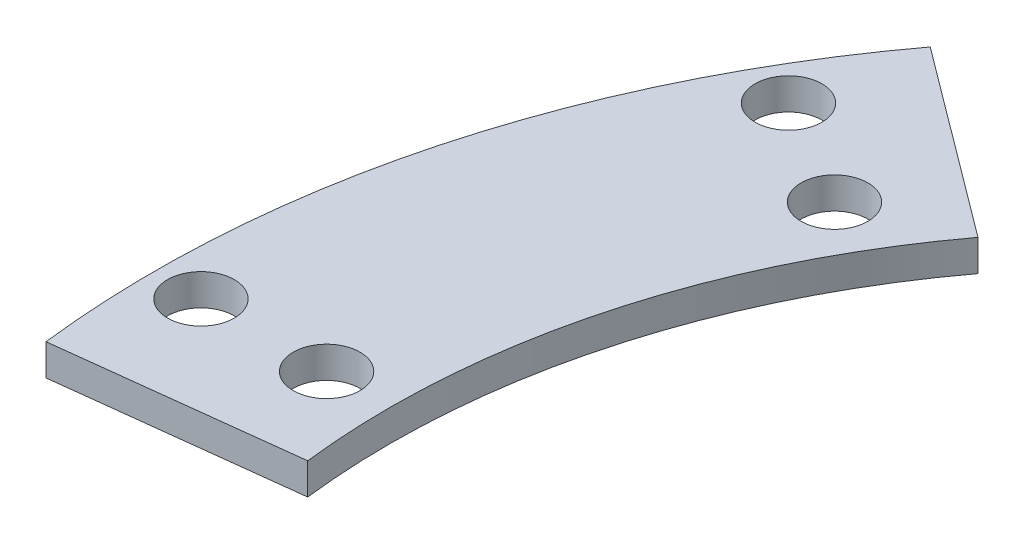
ISO-10303-21;
HEADER;
FILE_DESCRIPTION(('STEP AP214'),'2;1');
FILE_NAME('part.step','',(''),(''),'','','');
FILE_SCHEMA(('AUTOMOTIVE_DESIGN { 1 0 10303 214 1 1 1 1 }'));
ENDSEC;
DATA;
#1=APPLICATION_CONTEXT('core data for automotive mechanical design processes');
#2=APPLICATION_PROTOCOL_DEFINITION('international standard','automotive_design',2000,#1);
#3=PRODUCT_CONTEXT('',#1,'mechanical');
#4=PRODUCT('Part','Part','',(#3));
#5=PRODUCT_RELATED_PRODUCT_CATEGORY('part','',(#4));
#6=PRODUCT_DEFINITION_FORMATION('','',#4);
#7=PRODUCT_DEFINITION_CONTEXT('part definition',#1,'design');
#8=PRODUCT_DEFINITION('design','',#6,#7);
#9=PRODUCT_DEFINITION_SHAPE('','',#8);
#10=(LENGTH_UNIT() NAMED_UNIT(*) SI_UNIT(.MILLI.,.METRE.));
#11=(NAMED_UNIT(*) PLANE_ANGLE_UNIT() SI_UNIT($,.RADIAN.));
#12=(NAMED_UNIT(*) SI_UNIT($,.STERADIAN.) SOLID_ANGLE_UNIT());
#13=UNCERTAINTY_MEASURE_WITH_UNIT(LENGTH_MEASURE(1.E-05),#10,'distance_accuracy_value','');
#14=(GEOMETRIC_REPRESENTATION_CONTEXT(3) GLOBAL_UNCERTAINTY_ASSIGNED_CONTEXT((#13)) GLOBAL_UNIT_ASSIGNED_CONTEXT((#10,
#11,#12)) REPRESENTATION_CONTEXT('',''));
#15=CARTESIAN_POINT('',(0.,0.,0.));
#16=DIRECTION('',(0.,0.,1.));
#17=DIRECTION('',(1.,0.,0.));
#18=AXIS2_PLACEMENT_3D('',#15,#16,#17);
#19=CARTESIAN_POINT('',(0.,2.,0.));
#20=DIRECTION('',(0.,1.,0.));
#21=DIRECTION('',(0.,0.,1.));
#22=AXIS2_PLACEMENT_3D('',#19,#20,#21);
#23=PLANE('',#22);
#24=CARTESIAN_POINT('',(-44.1672955930063,2.,-25.5));
#25=DIRECTION('',(0.,1.,0.));
#26=DIRECTION('',(0.,0.,1.));
#27=AXIS2_PLACEMENT_3D('',#24,#25,#26);
#28=CIRCLE('',#27,2.125);
#29=CARTESIAN_POINT('',(-44.1672955930063,2.,-23.375));
#30=VERTEX_POINT('',#29);
#31=EDGE_CURVE('E123',#30,#30,#28,.T.);
#32=ORIENTED_EDGE('',*,*,#31,.F.);
#33=EDGE_LOOP('',(#32));
#34=FACE_BOUND('',#33,.T.);
#35=CARTESIAN_POINT('',(-51.0954988232818,2.,-29.5));
#36=DIRECTION('',(0.,1.,0.));
#37=DIRECTION('',(0.,0.,1.));
#38=AXIS2_PLACEMENT_3D('',#35,#36,#37);
#39=CIRCLE('',#38,2.125);
#40=CARTESIAN_POINT('',(-51.0954988232818,2.,-27.3750000000001));
#41=VERTEX_POINT('',#40);
#42=EDGE_CURVE('E102',#41,#41,#39,.T.);
#43=ORIENTED_EDGE('',*,*,#42,.F.);
#44=EDGE_LOOP('',(#43));
#45=FACE_BOUND('',#44,.T.);
#46=CARTESIAN_POINT('',(0.,2.,0.));
#47=DIRECTION('',(0.,-1.,0.));
#48=DIRECTION('',(0.,0.,1.));
#49=AXIS2_PLACEMENT_3D('',#46,#47,#48);
#50=CIRCLE('',#49,47.);
#51=CARTESIAN_POINT('',(-46.6736071622532,2.,5.52941176470589));
#52=VERTEX_POINT('',#51);
#53=CARTESIAN_POINT('',(-37.6558236064136,2.,-28.1254146373465));
#54=VERTEX_POINT('',#53);
#55=EDGE_CURVE('E87',#52,#54,#50,.T.);
#56=ORIENTED_EDGE('',*,*,#55,.T.);
#57=DIRECTION('',(-0.801187736306673,0.,-0.59841307739035));
#58=VECTOR('',#57,1.);
#59=CARTESIAN_POINT('',(-37.6558236064136,2.,-28.1254146373465));
#60=LINE('',#59,#58);
#61=CARTESIAN_POINT('',(-49.6736396510137,2.,-37.1016107982017));
#62=VERTEX_POINT('',#61);
#63=EDGE_CURVE('E82',#54,#62,#60,.T.);
#64=ORIENTED_EDGE('',*,*,#63,.T.);
#65=CARTESIAN_POINT('',(0.,2.,0.));
#66=DIRECTION('',(0.,1.,0.));
#67=DIRECTION('',(0.,0.,1.));
#68=AXIS2_PLACEMENT_3D('',#65,#66,#67);
#69=CIRCLE('',#68,62.);
#70=CARTESIAN_POINT('',(-61.5694392353127,2.,7.2941176470588));
#71=VERTEX_POINT('',#70);
#72=EDGE_CURVE('E85',#62,#71,#69,.T.);
#73=ORIENTED_EDGE('',*,*,#72,.T.);
#74=DIRECTION('',(0.993055471537302,0.,-0.117647058823529));
#75=VECTOR('',#74,1.);
#76=CARTESIAN_POINT('',(-46.6736071622532,2.,5.52941176470589));
#77=LINE('',#76,#75);
#78=EDGE_CURVE('E52',#71,#52,#77,.T.);
#79=ORIENTED_EDGE('',*,*,#78,.T.);
#80=EDGE_LOOP('',(#56,#64,#73,#79));
#81=FACE_BOUND('',#80,.T.);
#82=CARTESIAN_POINT('',(-59.,2.,0.));
#83=DIRECTION('',(0.,1.,0.));
#84=DIRECTION('',(0.,0.,1.));
#85=AXIS2_PLACEMENT_3D('',#82,#83,#84);
#86=CIRCLE('',#85,2.125);
#87=CARTESIAN_POINT('',(-59.,2.,2.12500000000001));
#88=VERTEX_POINT('',#87);
#89=EDGE_CURVE('E117',#88,#88,#86,.T.);
#90=ORIENTED_EDGE('',*,*,#89,.F.);
#91=EDGE_LOOP('',(#90));
#92=FACE_BOUND('',#91,.T.);
#93=CARTESIAN_POINT('',(-51.,2.,0.));
#94=DIRECTION('',(0.,1.,0.));
#95=DIRECTION('',(0.,0.,1.));
#96=AXIS2_PLACEMENT_3D('',#93,#94,#95);
#97=CIRCLE('',#96,2.125);
#98=CARTESIAN_POINT('',(-51.,2.,2.12500000000001));
#99=VERTEX_POINT('',#98);
#100=EDGE_CURVE('E129',#99,#99,#97,.T.);
#101=ORIENTED_EDGE('',*,*,#100,.F.);
#102=EDGE_LOOP('',(#101));
#103=FACE_BOUND('',#102,.T.);
#104=ADVANCED_FACE('F35',(#34,#45,#81,#92,#103),#23,.T.);
#105=CARTESIAN_POINT('',(0.,0.,0.));
#106=DIRECTION('',(0.,1.,0.));
#107=DIRECTION('',(0.,0.,1.));
#108=AXIS2_PLACEMENT_3D('',#105,#106,#107);
#109=PLANE('',#108);
#110=CARTESIAN_POINT('',(0.,0.,0.));
#111=DIRECTION('',(0.,-1.,0.));
#112=DIRECTION('',(0.,0.,1.));
#113=AXIS2_PLACEMENT_3D('',#110,#111,#112);
#114=CIRCLE('',#113,47.);
#115=CARTESIAN_POINT('',(-46.6736071622532,0.,5.52941176470589));
#116=VERTEX_POINT('',#115);
#117=CARTESIAN_POINT('',(-37.6558236064136,0.,-28.1254146373465));
#118=VERTEX_POINT('',#117);
#119=EDGE_CURVE('E99',#116,#118,#114,.T.);
#120=ORIENTED_EDGE('',*,*,#119,.F.);
#121=DIRECTION('',(0.993055471537302,0.,-0.117647058823529));
#122=VECTOR('',#121,1.);
#123=CARTESIAN_POINT('',(-46.6736071622532,0.,5.52941176470589));
#124=LINE('',#123,#122);
#125=CARTESIAN_POINT('',(-61.5694392353127,0.,7.2941176470588));
#126=VERTEX_POINT('',#125);
#127=EDGE_CURVE('E75',#126,#116,#124,.T.);
#128=ORIENTED_EDGE('',*,*,#127,.F.);
#129=CARTESIAN_POINT('',(0.,0.,0.));
#130=DIRECTION('',(0.,1.,0.));
#131=DIRECTION('',(0.,0.,1.));
#132=AXIS2_PLACEMENT_3D('',#129,#130,#131);
#133=CIRCLE('',#132,62.);
#134=CARTESIAN_POINT('',(-49.6736396510137,0.,-37.1016107982017));
#135=VERTEX_POINT('',#134);
#136=EDGE_CURVE('E69',#135,#126,#133,.T.);
#137=ORIENTED_EDGE('',*,*,#136,.F.);
#138=DIRECTION('',(-0.801187736306673,0.,-0.59841307739035));
#139=VECTOR('',#138,1.);
#140=CARTESIAN_POINT('',(-37.6558236064136,0.,-28.1254146373465));
#141=LINE('',#140,#139);
#142=EDGE_CURVE('E91',#118,#135,#141,.T.);
#143=ORIENTED_EDGE('',*,*,#142,.F.);
#144=EDGE_LOOP('',(#120,#128,#137,#143));
#145=FACE_BOUND('',#144,.T.);
#146=CARTESIAN_POINT('',(-51.0954988232818,0.,-29.5));
#147=DIRECTION('',(0.,1.,0.));
#148=DIRECTION('',(0.,0.,1.));
#149=AXIS2_PLACEMENT_3D('',#146,#147,#148);
#150=CIRCLE('',#149,2.125);
#151=CARTESIAN_POINT('',(-51.0954988232818,0.,-27.3750000000001));
#152=VERTEX_POINT('',#151);
#153=EDGE_CURVE('E114',#152,#152,#150,.T.);
#154=ORIENTED_EDGE('',*,*,#153,.T.);
#155=EDGE_LOOP('',(#154));
#156=FACE_BOUND('',#155,.T.);
#157=CARTESIAN_POINT('',(-59.,0.,0.));
#158=DIRECTION('',(0.,1.,0.));
#159=DIRECTION('',(0.,0.,1.));
#160=AXIS2_PLACEMENT_3D('',#157,#158,#159);
#161=CIRCLE('',#160,2.125);
#162=CARTESIAN_POINT('',(-59.,0.,2.12500000000001));
#163=VERTEX_POINT('',#162);
#164=EDGE_CURVE('E120',#163,#163,#161,.T.);
#165=ORIENTED_EDGE('',*,*,#164,.T.);
#166=EDGE_LOOP('',(#165));
#167=FACE_BOUND('',#166,.T.);
#168=CARTESIAN_POINT('',(-44.1672955930063,0.,-25.5));
#169=DIRECTION('',(0.,1.,0.));
#170=DIRECTION('',(0.,0.,1.));
#171=AXIS2_PLACEMENT_3D('',#168,#169,#170);
#172=CIRCLE('',#171,2.125);
#173=CARTESIAN_POINT('',(-44.1672955930063,0.,-23.375));
#174=VERTEX_POINT('',#173);
#175=EDGE_CURVE('E126',#174,#174,#172,.T.);
#176=ORIENTED_EDGE('',*,*,#175,.T.);
#177=EDGE_LOOP('',(#176));
#178=FACE_BOUND('',#177,.T.);
#179=CARTESIAN_POINT('',(-51.,0.,0.));
#180=DIRECTION('',(0.,1.,0.));
#181=DIRECTION('',(0.,0.,1.));
#182=AXIS2_PLACEMENT_3D('',#179,#180,#181);
#183=CIRCLE('',#182,2.125);
#184=CARTESIAN_POINT('',(-51.,0.,2.12500000000001));
#185=VERTEX_POINT('',#184);
#186=EDGE_CURVE('E132',#185,#185,#183,.T.);
#187=ORIENTED_EDGE('',*,*,#186,.T.);
#188=EDGE_LOOP('',(#187));
#189=FACE_BOUND('',#188,.T.);
#190=ADVANCED_FACE('F110',(#145,#156,#167,#178,#189),#109,.F.);
#191=CARTESIAN_POINT('',(0.,2.,0.));
#192=DIRECTION('',(0.,-1.,0.));
#193=DIRECTION('',(0.,0.,-1.));
#194=AXIS2_PLACEMENT_3D('',#191,#192,#193);
#195=CYLINDRICAL_SURFACE('',#194,47.);
#196=ORIENTED_EDGE('',*,*,#119,.T.);
#197=DIRECTION('',(0.,-1.,0.));
#198=VECTOR('',#197,1.);
#199=CARTESIAN_POINT('',(-37.6558236064136,2.,-28.1254146373465));
#200=LINE('',#199,#198);
#201=EDGE_CURVE('E11',#54,#118,#200,.T.);
#202=ORIENTED_EDGE('',*,*,#201,.F.);
#203=ORIENTED_EDGE('',*,*,#55,.F.);
#204=DIRECTION('',(0.,-1.,0.));
#205=VECTOR('',#204,1.);
#206=CARTESIAN_POINT('',(-46.6736071622532,2.,5.52941176470589));
#207=LINE('',#206,#205);
#208=EDGE_CURVE('E95',#52,#116,#207,.T.);
#209=ORIENTED_EDGE('',*,*,#208,.T.);
#210=EDGE_LOOP('',(#196,#202,#203,#209));
#211=FACE_BOUND('',#210,.T.);
#212=ADVANCED_FACE('F37',(#211),#195,.F.);
#213=CARTESIAN_POINT('',(-37.6558236064136,2.,-28.1254146373465));
#214=DIRECTION('',(-0.59841307739035,0.,0.801187736306673));
#215=DIRECTION('',(0.801187736306673,0.,0.59841307739035));
#216=AXIS2_PLACEMENT_3D('',#213,#214,#215);
#217=PLANE('',#216);
#218=ORIENTED_EDGE('',*,*,#142,.T.);
#219=DIRECTION('',(0.,-1.,0.));
#220=VECTOR('',#219,1.);
#221=CARTESIAN_POINT('',(-49.6736396510137,2.,-37.1016107982017));
#222=LINE('',#221,#220);
#223=EDGE_CURVE('E44',#62,#135,#222,.T.);
#224=ORIENTED_EDGE('',*,*,#223,.F.);
#225=ORIENTED_EDGE('',*,*,#63,.F.);
#226=ORIENTED_EDGE('',*,*,#201,.T.);
#227=EDGE_LOOP('',(#218,#224,#225,#226));
#228=FACE_BOUND('',#227,.T.);
#229=ADVANCED_FACE('F90',(#228),#217,.F.);
#230=CARTESIAN_POINT('',(0.,2.,0.));
#231=DIRECTION('',(0.,-1.,0.));
#232=DIRECTION('',(0.,0.,-1.));
#233=AXIS2_PLACEMENT_3D('',#230,#231,#232);
#234=CYLINDRICAL_SURFACE('',#233,62.);
#235=ORIENTED_EDGE('',*,*,#136,.T.);
#236=DIRECTION('',(0.,-1.,0.));
#237=VECTOR('',#236,1.);
#238=CARTESIAN_POINT('',(-61.5694392353127,2.,7.2941176470588));
#239=LINE('',#238,#237);
#240=EDGE_CURVE('E92',#71,#126,#239,.T.);
#241=ORIENTED_EDGE('',*,*,#240,.F.);
#242=ORIENTED_EDGE('',*,*,#72,.F.);
#243=ORIENTED_EDGE('',*,*,#223,.T.);
#244=EDGE_LOOP('',(#235,#241,#242,#243));
#245=FACE_BOUND('',#244,.T.);
#246=ADVANCED_FACE('F93',(#245),#234,.T.);
#247=CARTESIAN_POINT('',(-46.6736071622532,2.,5.52941176470589));
#248=DIRECTION('',(-0.117647058823529,0.,-0.993055471537302));
#249=DIRECTION('',(-0.993055471537302,0.,0.117647058823529));
#250=AXIS2_PLACEMENT_3D('',#247,#248,#249);
#251=PLANE('',#250);
#252=ORIENTED_EDGE('',*,*,#127,.T.);
#253=ORIENTED_EDGE('',*,*,#208,.F.);
#254=ORIENTED_EDGE('',*,*,#78,.F.);
#255=ORIENTED_EDGE('',*,*,#240,.T.);
#256=EDGE_LOOP('',(#252,#253,#254,#255));
#257=FACE_BOUND('',#256,.T.);
#258=ADVANCED_FACE('F107',(#257),#251,.F.);
#259=CARTESIAN_POINT('',(-51.0954988232818,2.,-29.5));
#260=DIRECTION('',(0.,-1.,0.));
#261=DIRECTION('',(0.,0.,-1.));
#262=AXIS2_PLACEMENT_3D('',#259,#260,#261);
#263=CYLINDRICAL_SURFACE('',#262,2.125);
#264=ORIENTED_EDGE('',*,*,#42,.T.);
#265=EDGE_LOOP('',(#264));
#266=FACE_BOUND('',#265,.T.);
#267=ORIENTED_EDGE('',*,*,#153,.F.);
#268=EDGE_LOOP('',(#267));
#269=FACE_BOUND('',#268,.T.);
#270=ADVANCED_FACE('F151',(#266,#269),#263,.F.);
#271=CARTESIAN_POINT('',(-59.,2.,0.));
#272=DIRECTION('',(0.,-1.,0.));
#273=DIRECTION('',(0.,0.,-1.));
#274=AXIS2_PLACEMENT_3D('',#271,#272,#273);
#275=CYLINDRICAL_SURFACE('',#274,2.125);
#276=ORIENTED_EDGE('',*,*,#89,.T.);
#277=EDGE_LOOP('',(#276));
#278=FACE_BOUND('',#277,.T.);
#279=ORIENTED_EDGE('',*,*,#164,.F.);
#280=EDGE_LOOP('',(#279));
#281=FACE_BOUND('',#280,.T.);
#282=ADVANCED_FACE('F197',(#278,#281),#275,.F.);
#283=CARTESIAN_POINT('',(-44.1672955930063,2.,-25.5));
#284=DIRECTION('',(0.,-1.,0.));
#285=DIRECTION('',(0.,0.,-1.));
#286=AXIS2_PLACEMENT_3D('',#283,#284,#285);
#287=CYLINDRICAL_SURFACE('',#286,2.125);
#288=ORIENTED_EDGE('',*,*,#31,.T.);
#289=EDGE_LOOP('',(#288));
#290=FACE_BOUND('',#289,.T.);
#291=ORIENTED_EDGE('',*,*,#175,.F.);
#292=EDGE_LOOP('',(#291));
#293=FACE_BOUND('',#292,.T.);
#294=ADVANCED_FACE('F205',(#290,#293),#287,.F.);
#295=CARTESIAN_POINT('',(-51.,2.,0.));
#296=DIRECTION('',(0.,-1.,0.));
#297=DIRECTION('',(0.,0.,-1.));
#298=AXIS2_PLACEMENT_3D('',#295,#296,#297);
#299=CYLINDRICAL_SURFACE('',#298,2.125);
#300=ORIENTED_EDGE('',*,*,#100,.T.);
#301=EDGE_LOOP('',(#300));
#302=FACE_BOUND('',#301,.T.);
#303=ORIENTED_EDGE('',*,*,#186,.F.);
#304=EDGE_LOOP('',(#303));
#305=FACE_BOUND('',#304,.T.);
#306=ADVANCED_FACE('F138',(#302,#305),#299,.F.);
#307=CLOSED_SHELL('',(#104,#190,#212,#229,#246,#258,#270,#282,#294,#306));
#308=MANIFOLD_SOLID_BREP('B2',#307);
#309=ADVANCED_BREP_SHAPE_REPRESENTATION('',(#18,#308),#14);
#310=SHAPE_DEFINITION_REPRESENTATION(#9,#309);
ENDSEC;
END-ISO-10303-21;
